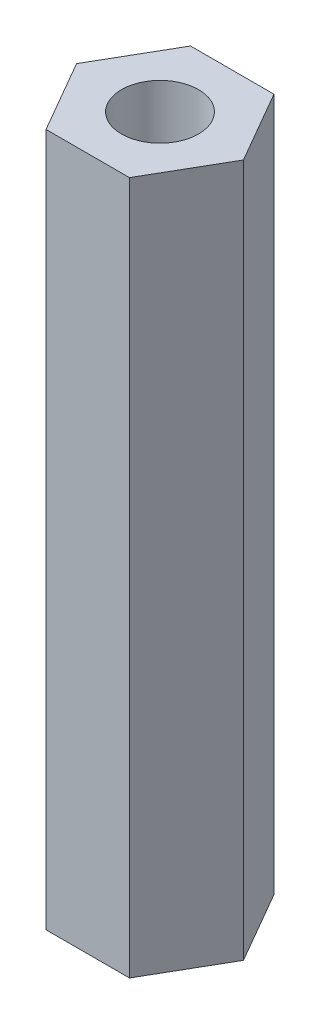
ISO-10303-21;
HEADER;
FILE_DESCRIPTION(('STEP AP214'),'2;1');
FILE_NAME('part.step','',(''),(''),'','','');
FILE_SCHEMA(('AUTOMOTIVE_DESIGN { 1 0 10303 214 1 1 1 1 }'));
ENDSEC;
DATA;
#1=APPLICATION_CONTEXT('core data for automotive mechanical design processes');
#2=APPLICATION_PROTOCOL_DEFINITION('international standard','automotive_design',2000,#1);
#3=PRODUCT_CONTEXT('',#1,'mechanical');
#4=PRODUCT('Part','Part','',(#3));
#5=PRODUCT_RELATED_PRODUCT_CATEGORY('part','',(#4));
#6=PRODUCT_DEFINITION_FORMATION('','',#4);
#7=PRODUCT_DEFINITION_CONTEXT('part definition',#1,'design');
#8=PRODUCT_DEFINITION('design','',#6,#7);
#9=PRODUCT_DEFINITION_SHAPE('','',#8);
#10=(LENGTH_UNIT() NAMED_UNIT(*) SI_UNIT(.MILLI.,.METRE.));
#11=(NAMED_UNIT(*) PLANE_ANGLE_UNIT() SI_UNIT($,.RADIAN.));
#12=(NAMED_UNIT(*) SI_UNIT($,.STERADIAN.) SOLID_ANGLE_UNIT());
#13=UNCERTAINTY_MEASURE_WITH_UNIT(LENGTH_MEASURE(1.E-05),#10,'distance_accuracy_value','');
#14=(GEOMETRIC_REPRESENTATION_CONTEXT(3) GLOBAL_UNCERTAINTY_ASSIGNED_CONTEXT((#13)) GLOBAL_UNIT_ASSIGNED_CONTEXT((#10,
#11,#12)) REPRESENTATION_CONTEXT('',''));
#15=CARTESIAN_POINT('',(0.,0.,0.));
#16=DIRECTION('',(0.,0.,1.));
#17=DIRECTION('',(1.,0.,0.));
#18=AXIS2_PLACEMENT_3D('',#15,#16,#17);
#19=CARTESIAN_POINT('',(0.,27.,0.));
#20=DIRECTION('',(0.,1.,0.));
#21=DIRECTION('',(0.,0.,1.));
#22=AXIS2_PLACEMENT_3D('',#19,#20,#21);
#23=PLANE('',#22);
#24=DIRECTION('',(0.499999999999995,0.,-0.866025403784442));
#25=VECTOR('',#24,1.);
#26=CARTESIAN_POINT('',(1.62500000000003,27.,2.81458256229941));
#27=LINE('',#26,#25);
#28=CARTESIAN_POINT('',(1.62500000000003,27.,2.81458256229941));
#29=VERTEX_POINT('',#28);
#30=CARTESIAN_POINT('',(3.25,27.,0.));
#31=VERTEX_POINT('',#30);
#32=EDGE_CURVE('E129',#29,#31,#27,.T.);
#33=ORIENTED_EDGE('',*,*,#32,.T.);
#34=DIRECTION('',(-0.500000000000001,0.,-0.866025403784438));
#35=VECTOR('',#34,1.);
#36=CARTESIAN_POINT('',(3.25,27.,0.));
#37=LINE('',#36,#35);
#38=CARTESIAN_POINT('',(1.62499999999999,27.,-2.81458256229943));
#39=VERTEX_POINT('',#38);
#40=EDGE_CURVE('E87',#31,#39,#37,.T.);
#41=ORIENTED_EDGE('',*,*,#40,.T.);
#42=DIRECTION('',(-1.,0.,0.));
#43=VECTOR('',#42,1.);
#44=CARTESIAN_POINT('',(1.62499999999999,27.,-2.81458256229943));
#45=LINE('',#44,#43);
#46=CARTESIAN_POINT('',(-1.62500000000001,27.,-2.81458256229942));
#47=VERTEX_POINT('',#46);
#48=EDGE_CURVE('E100',#39,#47,#45,.T.);
#49=ORIENTED_EDGE('',*,*,#48,.T.);
#50=DIRECTION('',(-0.499999999999995,0.,0.866025403784442));
#51=VECTOR('',#50,1.);
#52=CARTESIAN_POINT('',(-1.62500000000001,27.,-2.81458256229942));
#53=LINE('',#52,#51);
#54=CARTESIAN_POINT('',(-3.25,27.,0.));
#55=VERTEX_POINT('',#54);
#56=EDGE_CURVE('E94',#47,#55,#53,.T.);
#57=ORIENTED_EDGE('',*,*,#56,.T.);
#58=DIRECTION('',(0.500000000000007,0.,0.866025403784435));
#59=VECTOR('',#58,1.);
#60=CARTESIAN_POINT('',(-3.25,27.,0.));
#61=LINE('',#60,#59);
#62=CARTESIAN_POINT('',(-1.62499999999997,27.,2.81458256229944));
#63=VERTEX_POINT('',#62);
#64=EDGE_CURVE('E98',#55,#63,#61,.T.);
#65=ORIENTED_EDGE('',*,*,#64,.T.);
#66=DIRECTION('',(1.,0.,0.));
#67=VECTOR('',#66,1.);
#68=CARTESIAN_POINT('',(-1.62499999999997,27.,2.81458256229944));
#69=LINE('',#68,#67);
#70=EDGE_CURVE('E50',#63,#29,#69,.T.);
#71=ORIENTED_EDGE('',*,*,#70,.T.);
#72=EDGE_LOOP('',(#33,#41,#49,#57,#65,#71));
#73=FACE_BOUND('',#72,.T.);
#74=CARTESIAN_POINT('',(0.,27.,0.));
#75=DIRECTION('',(0.,1.,0.));
#76=DIRECTION('',(0.,0.,1.));
#77=AXIS2_PLACEMENT_3D('',#74,#75,#76);
#78=CIRCLE('',#77,1.5);
#79=CARTESIAN_POINT('',(0.,27.,1.5));
#80=VERTEX_POINT('',#79);
#81=EDGE_CURVE('E122',#80,#80,#78,.T.);
#82=ORIENTED_EDGE('',*,*,#81,.F.);
#83=EDGE_LOOP('',(#82));
#84=FACE_BOUND('',#83,.T.);
#85=ADVANCED_FACE('F33',(#73,#84),#23,.T.);
#86=CARTESIAN_POINT('',(0.,0.,0.));
#87=DIRECTION('',(0.,1.,0.));
#88=DIRECTION('',(0.,0.,1.));
#89=AXIS2_PLACEMENT_3D('',#86,#87,#88);
#90=PLANE('',#89);
#91=DIRECTION('',(0.499999999999995,0.,-0.866025403784442));
#92=VECTOR('',#91,1.);
#93=CARTESIAN_POINT('',(1.62500000000003,0.,2.81458256229941));
#94=LINE('',#93,#92);
#95=CARTESIAN_POINT('',(1.62500000000003,0.,2.81458256229941));
#96=VERTEX_POINT('',#95);
#97=CARTESIAN_POINT('',(3.25,0.,0.));
#98=VERTEX_POINT('',#97);
#99=EDGE_CURVE('E118',#96,#98,#94,.T.);
#100=ORIENTED_EDGE('',*,*,#99,.F.);
#101=DIRECTION('',(1.,0.,0.));
#102=VECTOR('',#101,1.);
#103=CARTESIAN_POINT('',(-1.62499999999997,0.,2.81458256229944));
#104=LINE('',#103,#102);
#105=CARTESIAN_POINT('',(-1.62499999999997,0.,2.81458256229944));
#106=VERTEX_POINT('',#105);
#107=EDGE_CURVE('E79',#106,#96,#104,.T.);
#108=ORIENTED_EDGE('',*,*,#107,.F.);
#109=DIRECTION('',(0.500000000000007,0.,0.866025403784435));
#110=VECTOR('',#109,1.);
#111=CARTESIAN_POINT('',(-3.25,0.,0.));
#112=LINE('',#111,#110);
#113=CARTESIAN_POINT('',(-3.25,0.,0.));
#114=VERTEX_POINT('',#113);
#115=EDGE_CURVE('E73',#114,#106,#112,.T.);
#116=ORIENTED_EDGE('',*,*,#115,.F.);
#117=DIRECTION('',(-0.499999999999995,0.,0.866025403784442));
#118=VECTOR('',#117,1.);
#119=CARTESIAN_POINT('',(-1.62500000000001,0.,-2.81458256229942));
#120=LINE('',#119,#118);
#121=CARTESIAN_POINT('',(-1.62500000000001,0.,-2.81458256229942));
#122=VERTEX_POINT('',#121);
#123=EDGE_CURVE('E108',#122,#114,#120,.T.);
#124=ORIENTED_EDGE('',*,*,#123,.F.);
#125=DIRECTION('',(-1.,0.,0.));
#126=VECTOR('',#125,1.);
#127=CARTESIAN_POINT('',(1.62499999999999,0.,-2.81458256229943));
#128=LINE('',#127,#126);
#129=CARTESIAN_POINT('',(1.62499999999999,0.,-2.81458256229943));
#130=VERTEX_POINT('',#129);
#131=EDGE_CURVE('E124',#130,#122,#128,.T.);
#132=ORIENTED_EDGE('',*,*,#131,.F.);
#133=DIRECTION('',(-0.500000000000001,0.,-0.866025403784438));
#134=VECTOR('',#133,1.);
#135=CARTESIAN_POINT('',(3.25,0.,0.));
#136=LINE('',#135,#134);
#137=EDGE_CURVE('E121',#98,#130,#136,.T.);
#138=ORIENTED_EDGE('',*,*,#137,.F.);
#139=EDGE_LOOP('',(#100,#108,#116,#124,#132,#138));
#140=FACE_BOUND('',#139,.T.);
#141=CARTESIAN_POINT('',(0.,0.,0.));
#142=DIRECTION('',(0.,1.,0.));
#143=DIRECTION('',(0.,0.,1.));
#144=AXIS2_PLACEMENT_3D('',#141,#142,#143);
#145=CIRCLE('',#144,1.5);
#146=CARTESIAN_POINT('',(0.,0.,1.5));
#147=VERTEX_POINT('',#146);
#148=EDGE_CURVE('E222',#147,#147,#145,.T.);
#149=ORIENTED_EDGE('',*,*,#148,.T.);
#150=EDGE_LOOP('',(#149));
#151=FACE_BOUND('',#150,.T.);
#152=ADVANCED_FACE('F138',(#140,#151),#90,.F.);
#153=CARTESIAN_POINT('',(1.62500000000003,27.,2.81458256229941));
#154=DIRECTION('',(-0.866025403784442,0.,-0.499999999999995));
#155=DIRECTION('',(-0.499999999999995,0.,0.866025403784442));
#156=AXIS2_PLACEMENT_3D('',#153,#154,#155);
#157=PLANE('',#156);
#158=ORIENTED_EDGE('',*,*,#99,.T.);
#159=DIRECTION('',(0.,-1.,0.));
#160=VECTOR('',#159,1.);
#161=CARTESIAN_POINT('',(3.25,27.,0.));
#162=LINE('',#161,#160);
#163=EDGE_CURVE('E11',#31,#98,#162,.T.);
#164=ORIENTED_EDGE('',*,*,#163,.F.);
#165=ORIENTED_EDGE('',*,*,#32,.F.);
#166=DIRECTION('',(0.,-1.,0.));
#167=VECTOR('',#166,1.);
#168=CARTESIAN_POINT('',(1.62500000000003,27.,2.81458256229941));
#169=LINE('',#168,#167);
#170=EDGE_CURVE('E114',#29,#96,#169,.T.);
#171=ORIENTED_EDGE('',*,*,#170,.T.);
#172=EDGE_LOOP('',(#158,#164,#165,#171));
#173=FACE_BOUND('',#172,.T.);
#174=ADVANCED_FACE('F35',(#173),#157,.F.);
#175=CARTESIAN_POINT('',(3.25,27.,0.));
#176=DIRECTION('',(-0.866025403784438,0.,0.500000000000001));
#177=DIRECTION('',(0.500000000000001,0.,0.866025403784438));
#178=AXIS2_PLACEMENT_3D('',#175,#176,#177);
#179=PLANE('',#178);
#180=ORIENTED_EDGE('',*,*,#137,.T.);
#181=DIRECTION('',(0.,-1.,0.));
#182=VECTOR('',#181,1.);
#183=CARTESIAN_POINT('',(1.62499999999999,27.,-2.81458256229943));
#184=LINE('',#183,#182);
#185=EDGE_CURVE('E42',#39,#130,#184,.T.);
#186=ORIENTED_EDGE('',*,*,#185,.F.);
#187=ORIENTED_EDGE('',*,*,#40,.F.);
#188=ORIENTED_EDGE('',*,*,#163,.T.);
#189=EDGE_LOOP('',(#180,#186,#187,#188));
#190=FACE_BOUND('',#189,.T.);
#191=ADVANCED_FACE('F163',(#190),#179,.F.);
#192=CARTESIAN_POINT('',(1.62499999999999,27.,-2.81458256229943));
#193=DIRECTION('',(0.,0.,1.));
#194=DIRECTION('',(1.,0.,0.));
#195=AXIS2_PLACEMENT_3D('',#192,#193,#194);
#196=PLANE('',#195);
#197=ORIENTED_EDGE('',*,*,#131,.T.);
#198=DIRECTION('',(0.,-1.,0.));
#199=VECTOR('',#198,1.);
#200=CARTESIAN_POINT('',(-1.62500000000001,27.,-2.81458256229942));
#201=LINE('',#200,#199);
#202=EDGE_CURVE('E109',#47,#122,#201,.T.);
#203=ORIENTED_EDGE('',*,*,#202,.F.);
#204=ORIENTED_EDGE('',*,*,#48,.F.);
#205=ORIENTED_EDGE('',*,*,#185,.T.);
#206=EDGE_LOOP('',(#197,#203,#204,#205));
#207=FACE_BOUND('',#206,.T.);
#208=ADVANCED_FACE('F135',(#207),#196,.F.);
#209=CARTESIAN_POINT('',(-1.62500000000001,27.,-2.81458256229942));
#210=DIRECTION('',(0.866025403784442,0.,0.499999999999995));
#211=DIRECTION('',(0.499999999999995,0.,-0.866025403784442));
#212=AXIS2_PLACEMENT_3D('',#209,#210,#211);
#213=PLANE('',#212);
#214=ORIENTED_EDGE('',*,*,#123,.T.);
#215=DIRECTION('',(0.,-1.,0.));
#216=VECTOR('',#215,1.);
#217=CARTESIAN_POINT('',(-3.25,27.,0.));
#218=LINE('',#217,#216);
#219=EDGE_CURVE('E105',#55,#114,#218,.T.);
#220=ORIENTED_EDGE('',*,*,#219,.F.);
#221=ORIENTED_EDGE('',*,*,#56,.F.);
#222=ORIENTED_EDGE('',*,*,#202,.T.);
#223=EDGE_LOOP('',(#214,#220,#221,#222));
#224=FACE_BOUND('',#223,.T.);
#225=ADVANCED_FACE('F106',(#224),#213,.F.);
#226=CARTESIAN_POINT('',(-3.25,27.,0.));
#227=DIRECTION('',(0.866025403784435,0.,-0.500000000000007));
#228=DIRECTION('',(-0.500000000000007,0.,-0.866025403784435));
#229=AXIS2_PLACEMENT_3D('',#226,#227,#228);
#230=PLANE('',#229);
#231=ORIENTED_EDGE('',*,*,#115,.T.);
#232=DIRECTION('',(0.,-1.,0.));
#233=VECTOR('',#232,1.);
#234=CARTESIAN_POINT('',(-1.62499999999997,27.,2.81458256229944));
#235=LINE('',#234,#233);
#236=EDGE_CURVE('E110',#63,#106,#235,.T.);
#237=ORIENTED_EDGE('',*,*,#236,.F.);
#238=ORIENTED_EDGE('',*,*,#64,.F.);
#239=ORIENTED_EDGE('',*,*,#219,.T.);
#240=EDGE_LOOP('',(#231,#237,#238,#239));
#241=FACE_BOUND('',#240,.T.);
#242=ADVANCED_FACE('F112',(#241),#230,.F.);
#243=CARTESIAN_POINT('',(-1.62499999999997,27.,2.81458256229944));
#244=DIRECTION('',(0.,0.,-1.));
#245=DIRECTION('',(-1.,0.,0.));
#246=AXIS2_PLACEMENT_3D('',#243,#244,#245);
#247=PLANE('',#246);
#248=ORIENTED_EDGE('',*,*,#107,.T.);
#249=ORIENTED_EDGE('',*,*,#170,.F.);
#250=ORIENTED_EDGE('',*,*,#70,.F.);
#251=ORIENTED_EDGE('',*,*,#236,.T.);
#252=EDGE_LOOP('',(#248,#249,#250,#251));
#253=FACE_BOUND('',#252,.T.);
#254=ADVANCED_FACE('F143',(#253),#247,.F.);
#255=CARTESIAN_POINT('',(0.,27.,0.));
#256=DIRECTION('',(0.,-1.,0.));
#257=DIRECTION('',(0.,0.,-1.));
#258=AXIS2_PLACEMENT_3D('',#255,#256,#257);
#259=CYLINDRICAL_SURFACE('',#258,1.5);
#260=ORIENTED_EDGE('',*,*,#81,.T.);
#261=EDGE_LOOP('',(#260));
#262=FACE_BOUND('',#261,.T.);
#263=ORIENTED_EDGE('',*,*,#148,.F.);
#264=EDGE_LOOP('',(#263));
#265=FACE_BOUND('',#264,.T.);
#266=ADVANCED_FACE('F145',(#262,#265),#259,.F.);
#267=CLOSED_SHELL('',(#85,#152,#174,#191,#208,#225,#242,#254,#266));
#268=MANIFOLD_SOLID_BREP('B2',#267);
#269=ADVANCED_BREP_SHAPE_REPRESENTATION('',(#18,#268),#14);
#270=SHAPE_DEFINITION_REPRESENTATION(#9,#269);
ENDSEC;
END-ISO-10303-21;
